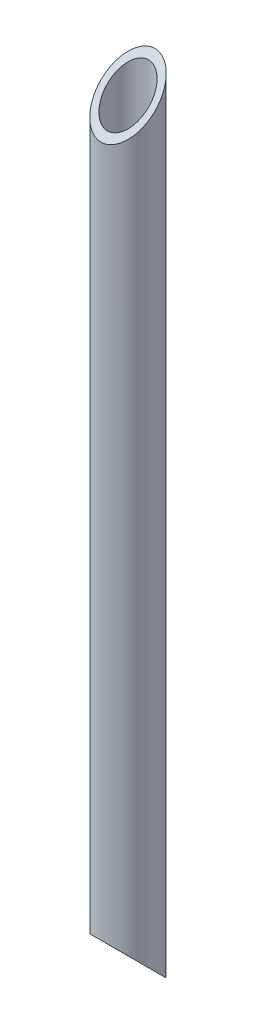
ISO-10303-21;
HEADER;
FILE_DESCRIPTION(('STEP AP214'),'2;1');
FILE_NAME('part.step','',(''),(''),'','','');
FILE_SCHEMA(('AUTOMOTIVE_DESIGN { 1 0 10303 214 1 1 1 1 }'));
ENDSEC;
DATA;
#1=APPLICATION_CONTEXT('core data for automotive mechanical design processes');
#2=APPLICATION_PROTOCOL_DEFINITION('international standard','automotive_design',2000,#1);
#3=PRODUCT_CONTEXT('',#1,'mechanical');
#4=PRODUCT('Part','Part','',(#3));
#5=PRODUCT_RELATED_PRODUCT_CATEGORY('part','',(#4));
#6=PRODUCT_DEFINITION_FORMATION('','',#4);
#7=PRODUCT_DEFINITION_CONTEXT('part definition',#1,'design');
#8=PRODUCT_DEFINITION('design','',#6,#7);
#9=PRODUCT_DEFINITION_SHAPE('','',#8);
#10=(LENGTH_UNIT() NAMED_UNIT(*) SI_UNIT(.MILLI.,.METRE.));
#11=(NAMED_UNIT(*) PLANE_ANGLE_UNIT() SI_UNIT($,.RADIAN.));
#12=(NAMED_UNIT(*) SI_UNIT($,.STERADIAN.) SOLID_ANGLE_UNIT());
#13=UNCERTAINTY_MEASURE_WITH_UNIT(LENGTH_MEASURE(1.E-05),#10,'distance_accuracy_value','');
#14=(GEOMETRIC_REPRESENTATION_CONTEXT(3) GLOBAL_UNCERTAINTY_ASSIGNED_CONTEXT((#13)) GLOBAL_UNIT_ASSIGNED_CONTEXT((#10,
#11,#12)) REPRESENTATION_CONTEXT('',''));
#15=CARTESIAN_POINT('',(0.,0.,0.));
#16=DIRECTION('',(0.,0.,1.));
#17=DIRECTION('',(1.,0.,0.));
#18=AXIS2_PLACEMENT_3D('',#15,#16,#17);
#19=CARTESIAN_POINT('',(-1.68322175520138E-13,350.,-200.000000000003));
#20=DIRECTION('',(0.,-1.,0.));
#21=DIRECTION('',(0.,0.,-1.));
#22=AXIS2_PLACEMENT_3D('',#19,#20,#21);
#23=CYLINDRICAL_SURFACE('',#22,9.65);
#24=CARTESIAN_POINT('',(-1.68322096110799E-13,0.,-200.000000000003));
#25=DIRECTION('',(0.,0.707106781186547,-0.707106781186548));
#26=DIRECTION('',(0.,-0.707106781186548,-0.707106781186548));
#27=AXIS2_PLACEMENT_3D('',#24,#25,#26);
#28=ELLIPSE('',#27,13.6471608769004,9.65);
#29=CARTESIAN_POINT('',(-1.6832653499524E-13,-9.65000000000005,-209.650000000003));
#30=VERTEX_POINT('',#29);
#31=EDGE_CURVE('E45',#30,#30,#28,.T.);
#32=ORIENTED_EDGE('',*,*,#31,.F.);
#33=EDGE_LOOP('',(#32));
#34=FACE_BOUND('',#33,.T.);
#35=CARTESIAN_POINT('',(-1.68322175520138E-13,350.,-200.000000000003));
#36=DIRECTION('',(0.,-0.707106781186548,-0.707106781186548));
#37=DIRECTION('',(0.,-0.707106781186548,0.707106781186548));
#38=AXIS2_PLACEMENT_3D('',#35,#36,#37);
#39=ELLIPSE('',#38,13.6471608769004,9.65);
#40=CARTESIAN_POINT('',(-1.68319216263844E-13,340.35,-190.350000000003));
#41=VERTEX_POINT('',#40);
#42=EDGE_CURVE('E58',#41,#41,#39,.T.);
#43=ORIENTED_EDGE('',*,*,#42,.F.);
#44=EDGE_LOOP('',(#43));
#45=FACE_BOUND('',#44,.T.);
#46=ADVANCED_FACE('F38',(#34,#45),#23,.F.);
#47=CARTESIAN_POINT('',(-1.67163752085649E-13,350.,-200.000000000003));
#48=DIRECTION('',(0.,-0.707106781186548,-0.707106781186548));
#49=DIRECTION('',(0.,0.707106781186548,-0.707106781186548));
#50=AXIS2_PLACEMENT_3D('',#47,#48,#49);
#51=PLANE('',#50);
#52=ORIENTED_EDGE('',*,*,#42,.T.);
#53=EDGE_LOOP('',(#52));
#54=FACE_BOUND('',#53,.T.);
#55=CARTESIAN_POINT('',(-1.68322175520138E-13,350.,-200.000000000003));
#56=DIRECTION('',(0.,-0.707106781186548,-0.707106781186548));
#57=DIRECTION('',(0.,-0.707106781186548,0.707106781186548));
#58=AXIS2_PLACEMENT_3D('',#55,#56,#57);
#59=ELLIPSE('',#58,17.9605122421383,12.7);
#60=CARTESIAN_POINT('',(-1.68318280954859E-13,337.3,-187.300000000003));
#61=VERTEX_POINT('',#60);
#62=EDGE_CURVE('E51',#61,#61,#59,.T.);
#63=ORIENTED_EDGE('',*,*,#62,.F.);
#64=EDGE_LOOP('',(#63));
#65=FACE_BOUND('',#64,.T.);
#66=ADVANCED_FACE('F65',(#54,#65),#51,.F.);
#67=CARTESIAN_POINT('',(-1.68322175520138E-13,350.,-200.000000000003));
#68=DIRECTION('',(0.,-1.,0.));
#69=DIRECTION('',(0.,0.,-1.));
#70=AXIS2_PLACEMENT_3D('',#67,#68,#69);
#71=CYLINDRICAL_SURFACE('',#70,12.7);
#72=CARTESIAN_POINT('',(-1.68322096110799E-13,0.,-200.000000000003));
#73=DIRECTION('',(0.,0.707106781186547,-0.707106781186548));
#74=DIRECTION('',(0.,-0.707106781186548,-0.707106781186548));
#75=AXIS2_PLACEMENT_3D('',#72,#73,#74);
#76=ELLIPSE('',#75,17.9605122421383,12.7);
#77=CARTESIAN_POINT('',(-1.68327937958717E-13,-12.7000000000001,-212.700000000003));
#78=VERTEX_POINT('',#77);
#79=EDGE_CURVE('E10',#78,#78,#76,.T.);
#80=ORIENTED_EDGE('',*,*,#79,.T.);
#81=EDGE_LOOP('',(#80));
#82=FACE_BOUND('',#81,.T.);
#83=ORIENTED_EDGE('',*,*,#62,.T.);
#84=EDGE_LOOP('',(#83));
#85=FACE_BOUND('',#84,.T.);
#86=ADVANCED_FACE('F73',(#82,#85),#71,.T.);
#87=CARTESIAN_POINT('',(-1.67163831494988E-13,0.,-200.000000000003));
#88=DIRECTION('',(0.,0.707106781186547,-0.707106781186548));
#89=DIRECTION('',(0.,0.707106781186548,0.707106781186548));
#90=AXIS2_PLACEMENT_3D('',#87,#88,#89);
#91=PLANE('',#90);
#92=ORIENTED_EDGE('',*,*,#31,.T.);
#93=EDGE_LOOP('',(#92));
#94=FACE_BOUND('',#93,.T.);
#95=ORIENTED_EDGE('',*,*,#79,.F.);
#96=EDGE_LOOP('',(#95));
#97=FACE_BOUND('',#96,.T.);
#98=ADVANCED_FACE('F78',(#94,#97),#91,.F.);
#99=CLOSED_SHELL('',(#46,#66,#86,#98));
#100=MANIFOLD_SOLID_BREP('B2',#99);
#101=ADVANCED_BREP_SHAPE_REPRESENTATION('',(#18,#100),#14);
#102=SHAPE_DEFINITION_REPRESENTATION(#9,#101);
ENDSEC;
END-ISO-10303-21;
